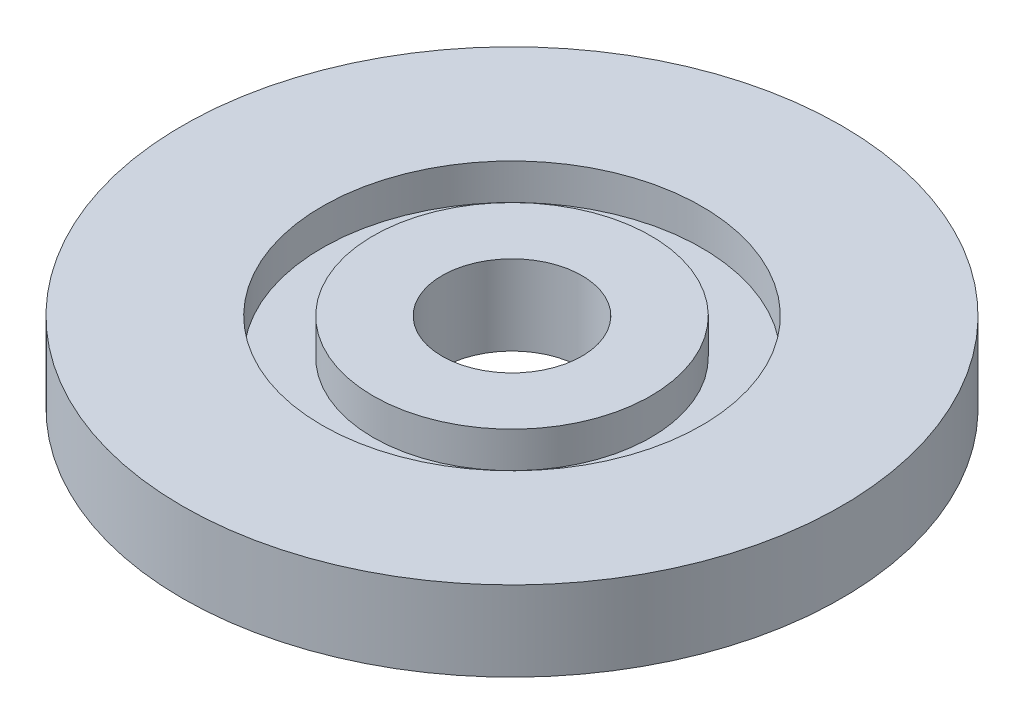
ISO-10303-21;
HEADER;
FILE_DESCRIPTION(('STEP AP214'),'2;1');
FILE_NAME('part.step','',(''),(''),'','','');
FILE_SCHEMA(('AUTOMOTIVE_DESIGN { 1 0 10303 214 1 1 1 1 }'));
ENDSEC;
DATA;
#1=APPLICATION_CONTEXT('core data for automotive mechanical design processes');
#2=APPLICATION_PROTOCOL_DEFINITION('international standard','automotive_design',2000,#1);
#3=PRODUCT_CONTEXT('',#1,'mechanical');
#4=PRODUCT('Part','Part','',(#3));
#5=PRODUCT_RELATED_PRODUCT_CATEGORY('part','',(#4));
#6=PRODUCT_DEFINITION_FORMATION('','',#4);
#7=PRODUCT_DEFINITION_CONTEXT('part definition',#1,'design');
#8=PRODUCT_DEFINITION('design','',#6,#7);
#9=PRODUCT_DEFINITION_SHAPE('','',#8);
#10=(LENGTH_UNIT() NAMED_UNIT(*) SI_UNIT(.MILLI.,.METRE.));
#11=(NAMED_UNIT(*) PLANE_ANGLE_UNIT() SI_UNIT($,.RADIAN.));
#12=(NAMED_UNIT(*) SI_UNIT($,.STERADIAN.) SOLID_ANGLE_UNIT());
#13=UNCERTAINTY_MEASURE_WITH_UNIT(LENGTH_MEASURE(1.E-05),#10,'distance_accuracy_value','');
#14=(GEOMETRIC_REPRESENTATION_CONTEXT(3) GLOBAL_UNCERTAINTY_ASSIGNED_CONTEXT((#13)) GLOBAL_UNIT_ASSIGNED_CONTEXT((#10,
#11,#12)) REPRESENTATION_CONTEXT('',''));
#15=CARTESIAN_POINT('',(0.,0.,0.));
#16=DIRECTION('',(0.,0.,1.));
#17=DIRECTION('',(1.,0.,0.));
#18=AXIS2_PLACEMENT_3D('',#15,#16,#17);
#19=CARTESIAN_POINT('',(0.,20.,0.));
#20=DIRECTION('',(0.,1.,0.));
#21=DIRECTION('',(0.,0.,1.));
#22=AXIS2_PLACEMENT_3D('',#19,#20,#21);
#23=PLANE('',#22);
#24=CARTESIAN_POINT('',(0.,20.,0.));
#25=DIRECTION('',(0.,1.,0.));
#26=DIRECTION('',(0.,0.,1.));
#27=AXIS2_PLACEMENT_3D('',#24,#25,#26);
#28=CIRCLE('',#27,17.5);
#29=CARTESIAN_POINT('',(0.,20.,17.5));
#30=VERTEX_POINT('',#29);
#31=EDGE_CURVE('E45',#30,#30,#28,.T.);
#32=ORIENTED_EDGE('',*,*,#31,.F.);
#33=EDGE_LOOP('',(#32));
#34=FACE_BOUND('',#33,.T.);
#35=CARTESIAN_POINT('',(0.,20.,0.));
#36=DIRECTION('',(0.,1.,0.));
#37=DIRECTION('',(0.,0.,1.));
#38=AXIS2_PLACEMENT_3D('',#35,#36,#37);
#39=CIRCLE('',#38,34.75);
#40=CARTESIAN_POINT('',(0.,20.,34.75));
#41=VERTEX_POINT('',#40);
#42=EDGE_CURVE('E57',#41,#41,#39,.T.);
#43=ORIENTED_EDGE('',*,*,#42,.T.);
#44=EDGE_LOOP('',(#43));
#45=FACE_BOUND('',#44,.T.);
#46=ADVANCED_FACE('F32',(#34,#45),#23,.T.);
#47=CARTESIAN_POINT('',(0.,20.,0.));
#48=DIRECTION('',(0.,-1.,0.));
#49=DIRECTION('',(0.,0.,-1.));
#50=AXIS2_PLACEMENT_3D('',#47,#48,#49);
#51=CYLINDRICAL_SURFACE('',#50,82.5);
#52=CARTESIAN_POINT('',(0.,20.,0.));
#53=DIRECTION('',(0.,1.,0.));
#54=DIRECTION('',(0.,0.,1.));
#55=AXIS2_PLACEMENT_3D('',#52,#53,#54);
#56=CIRCLE('',#55,82.5);
#57=CARTESIAN_POINT('',(0.,20.,82.5));
#58=VERTEX_POINT('',#57);
#59=EDGE_CURVE('E10',#58,#58,#56,.T.);
#60=ORIENTED_EDGE('',*,*,#59,.F.);
#61=EDGE_LOOP('',(#60));
#62=FACE_BOUND('',#61,.T.);
#63=CARTESIAN_POINT('',(0.,0.,0.));
#64=DIRECTION('',(0.,1.,0.));
#65=DIRECTION('',(0.,0.,1.));
#66=AXIS2_PLACEMENT_3D('',#63,#64,#65);
#67=CIRCLE('',#66,82.5);
#68=CARTESIAN_POINT('',(0.,0.,82.5));
#69=VERTEX_POINT('',#68);
#70=EDGE_CURVE('E36',#69,#69,#67,.T.);
#71=ORIENTED_EDGE('',*,*,#70,.T.);
#72=EDGE_LOOP('',(#71));
#73=FACE_BOUND('',#72,.T.);
#74=ADVANCED_FACE('F34',(#62,#73),#51,.T.);
#75=CARTESIAN_POINT('',(0.,20.,0.));
#76=DIRECTION('',(0.,1.,0.));
#77=DIRECTION('',(0.,0.,1.));
#78=AXIS2_PLACEMENT_3D('',#75,#76,#77);
#79=CIRCLE('',#78,47.5);
#80=CARTESIAN_POINT('',(0.,20.,47.5));
#81=VERTEX_POINT('',#80);
#82=EDGE_CURVE('E51',#81,#81,#79,.T.);
#83=ORIENTED_EDGE('',*,*,#82,.F.);
#84=EDGE_LOOP('',(#83));
#85=FACE_BOUND('',#84,.T.);
#86=ORIENTED_EDGE('',*,*,#59,.T.);
#87=EDGE_LOOP('',(#86));
#88=FACE_BOUND('',#87,.T.);
#89=ADVANCED_FACE('F112',(#85,#88),#23,.T.);
#90=CARTESIAN_POINT('',(0.,0.,0.));
#91=DIRECTION('',(0.,1.,0.));
#92=DIRECTION('',(0.,0.,1.));
#93=AXIS2_PLACEMENT_3D('',#90,#91,#92);
#94=PLANE('',#93);
#95=CARTESIAN_POINT('',(60.6217782649119,0.,35.0000000000021));
#96=DIRECTION('',(0.,-1.,0.));
#97=DIRECTION('',(0.,0.,-1.));
#98=AXIS2_PLACEMENT_3D('',#95,#96,#97);
#99=CIRCLE('',#98,2.50000000000001);
#100=CARTESIAN_POINT('',(60.6217782649119,0.,32.500000000002));
#101=VERTEX_POINT('',#100);
#102=EDGE_CURVE('E93',#101,#101,#99,.T.);
#103=ORIENTED_EDGE('',*,*,#102,.F.);
#104=EDGE_LOOP('',(#103));
#105=FACE_BOUND('',#104,.T.);
#106=CARTESIAN_POINT('',(60.6217782649142,0.,-34.999999999998));
#107=DIRECTION('',(0.,-1.,0.));
#108=DIRECTION('',(0.,0.,-1.));
#109=AXIS2_PLACEMENT_3D('',#106,#107,#108);
#110=CIRCLE('',#109,2.50000000000002);
#111=CARTESIAN_POINT('',(60.6217782649142,0.,-37.499999999998));
#112=VERTEX_POINT('',#111);
#113=EDGE_CURVE('E87',#112,#112,#110,.T.);
#114=ORIENTED_EDGE('',*,*,#113,.F.);
#115=EDGE_LOOP('',(#114));
#116=FACE_BOUND('',#115,.T.);
#117=CARTESIAN_POINT('',(4.67794791142476E-12,0.,-70.));
#118=DIRECTION('',(0.,-1.,0.));
#119=DIRECTION('',(0.,0.,-1.));
#120=AXIS2_PLACEMENT_3D('',#117,#118,#119);
#121=CIRCLE('',#120,2.5);
#122=CARTESIAN_POINT('',(4.67794791142476E-12,0.,-72.5));
#123=VERTEX_POINT('',#122);
#124=EDGE_CURVE('E81',#123,#123,#121,.T.);
#125=ORIENTED_EDGE('',*,*,#124,.F.);
#126=EDGE_LOOP('',(#125));
#127=FACE_BOUND('',#126,.T.);
#128=CARTESIAN_POINT('',(-60.6217782649072,0.,-35.0000000000021));
#129=DIRECTION('',(0.,-1.,0.));
#130=DIRECTION('',(0.,0.,-1.));
#131=AXIS2_PLACEMENT_3D('',#128,#129,#130);
#132=CIRCLE('',#131,2.5);
#133=CARTESIAN_POINT('',(-60.6217782649072,0.,-37.5000000000021));
#134=VERTEX_POINT('',#133);
#135=EDGE_CURVE('E75',#134,#134,#132,.T.);
#136=ORIENTED_EDGE('',*,*,#135,.F.);
#137=EDGE_LOOP('',(#136));
#138=FACE_BOUND('',#137,.T.);
#139=CARTESIAN_POINT('',(-60.6217782649096,0.,34.9999999999979));
#140=DIRECTION('',(0.,-1.,0.));
#141=DIRECTION('',(0.,0.,-1.));
#142=AXIS2_PLACEMENT_3D('',#139,#140,#141);
#143=CIRCLE('',#142,2.5);
#144=CARTESIAN_POINT('',(-60.6217782649096,0.,32.4999999999979));
#145=VERTEX_POINT('',#144);
#146=EDGE_CURVE('E69',#145,#145,#143,.T.);
#147=ORIENTED_EDGE('',*,*,#146,.F.);
#148=EDGE_LOOP('',(#147));
#149=FACE_BOUND('',#148,.T.);
#150=CARTESIAN_POINT('',(0.,0.,70.));
#151=DIRECTION('',(0.,-1.,0.));
#152=DIRECTION('',(0.,0.,-1.));
#153=AXIS2_PLACEMENT_3D('',#150,#151,#152);
#154=CIRCLE('',#153,2.5);
#155=CARTESIAN_POINT('',(0.,0.,67.5));
#156=VERTEX_POINT('',#155);
#157=EDGE_CURVE('E63',#156,#156,#154,.T.);
#158=ORIENTED_EDGE('',*,*,#157,.F.);
#159=EDGE_LOOP('',(#158));
#160=FACE_BOUND('',#159,.T.);
#161=CARTESIAN_POINT('',(0.,0.,0.));
#162=DIRECTION('',(0.,1.,0.));
#163=DIRECTION('',(0.,0.,1.));
#164=AXIS2_PLACEMENT_3D('',#161,#162,#163);
#165=CIRCLE('',#164,17.5);
#166=CARTESIAN_POINT('',(0.,0.,17.5));
#167=VERTEX_POINT('',#166);
#168=EDGE_CURVE('E43',#167,#167,#165,.T.);
#169=ORIENTED_EDGE('',*,*,#168,.T.);
#170=EDGE_LOOP('',(#169));
#171=FACE_BOUND('',#170,.T.);
#172=ORIENTED_EDGE('',*,*,#70,.F.);
#173=EDGE_LOOP('',(#172));
#174=FACE_BOUND('',#173,.T.);
#175=ADVANCED_FACE('F108',(#105,#116,#127,#138,#149,#160,#171,#174),#94,.F.);
#176=CARTESIAN_POINT('',(0.,0.,0.));
#177=DIRECTION('',(0.,1.,0.));
#178=DIRECTION('',(0.,0.,1.));
#179=AXIS2_PLACEMENT_3D('',#176,#177,#178);
#180=CYLINDRICAL_SURFACE('',#179,17.5);
#181=ORIENTED_EDGE('',*,*,#168,.F.);
#182=EDGE_LOOP('',(#181));
#183=FACE_BOUND('',#182,.T.);
#184=ORIENTED_EDGE('',*,*,#31,.T.);
#185=EDGE_LOOP('',(#184));
#186=FACE_BOUND('',#185,.T.);
#187=ADVANCED_FACE('F111',(#183,#186),#180,.F.);
#188=CARTESIAN_POINT('',(0.,11.,0.));
#189=DIRECTION('',(0.,1.,0.));
#190=DIRECTION('',(0.,0.,1.));
#191=AXIS2_PLACEMENT_3D('',#188,#189,#190);
#192=CYLINDRICAL_SURFACE('',#191,47.5);
#193=CARTESIAN_POINT('',(0.,11.,0.));
#194=DIRECTION('',(0.,1.,0.));
#195=DIRECTION('',(0.,0.,1.));
#196=AXIS2_PLACEMENT_3D('',#193,#194,#195);
#197=CIRCLE('',#196,47.5);
#198=CARTESIAN_POINT('',(0.,11.,47.5));
#199=VERTEX_POINT('',#198);
#200=EDGE_CURVE('E48',#199,#199,#197,.T.);
#201=ORIENTED_EDGE('',*,*,#200,.F.);
#202=EDGE_LOOP('',(#201));
#203=FACE_BOUND('',#202,.T.);
#204=ORIENTED_EDGE('',*,*,#82,.T.);
#205=EDGE_LOOP('',(#204));
#206=FACE_BOUND('',#205,.T.);
#207=ADVANCED_FACE('F143',(#203,#206),#192,.F.);
#208=CARTESIAN_POINT('',(0.,11.,0.));
#209=DIRECTION('',(0.,1.,0.));
#210=DIRECTION('',(0.,0.,1.));
#211=AXIS2_PLACEMENT_3D('',#208,#209,#210);
#212=PLANE('',#211);
#213=CARTESIAN_POINT('',(0.,11.,0.));
#214=DIRECTION('',(0.,1.,0.));
#215=DIRECTION('',(0.,0.,1.));
#216=AXIS2_PLACEMENT_3D('',#213,#214,#215);
#217=CIRCLE('',#216,34.75);
#218=CARTESIAN_POINT('',(0.,11.,34.75));
#219=VERTEX_POINT('',#218);
#220=EDGE_CURVE('E54',#219,#219,#217,.T.);
#221=ORIENTED_EDGE('',*,*,#220,.F.);
#222=EDGE_LOOP('',(#221));
#223=FACE_BOUND('',#222,.T.);
#224=ORIENTED_EDGE('',*,*,#200,.T.);
#225=EDGE_LOOP('',(#224));
#226=FACE_BOUND('',#225,.T.);
#227=ADVANCED_FACE('F147',(#223,#226),#212,.T.);
#228=CARTESIAN_POINT('',(0.,11.,0.));
#229=DIRECTION('',(0.,1.,0.));
#230=DIRECTION('',(0.,0.,1.));
#231=AXIS2_PLACEMENT_3D('',#228,#229,#230);
#232=CYLINDRICAL_SURFACE('',#231,34.75);
#233=ORIENTED_EDGE('',*,*,#220,.T.);
#234=EDGE_LOOP('',(#233));
#235=FACE_BOUND('',#234,.T.);
#236=ORIENTED_EDGE('',*,*,#42,.F.);
#237=EDGE_LOOP('',(#236));
#238=FACE_BOUND('',#237,.T.);
#239=ADVANCED_FACE('F151',(#235,#238),#232,.T.);
#240=CARTESIAN_POINT('',(0.,13.,70.));
#241=DIRECTION('',(0.,-1.,0.));
#242=DIRECTION('',(0.,0.,-1.));
#243=AXIS2_PLACEMENT_3D('',#240,#241,#242);
#244=CYLINDRICAL_SURFACE('',#243,2.5);
#245=CARTESIAN_POINT('',(0.,13.,70.));
#246=DIRECTION('',(0.,-1.,0.));
#247=DIRECTION('',(0.,0.,-1.));
#248=AXIS2_PLACEMENT_3D('',#245,#246,#247);
#249=CIRCLE('',#248,2.5);
#250=CARTESIAN_POINT('',(0.,13.,67.5));
#251=VERTEX_POINT('',#250);
#252=EDGE_CURVE('E60',#251,#251,#249,.T.);
#253=ORIENTED_EDGE('',*,*,#252,.F.);
#254=EDGE_LOOP('',(#253));
#255=FACE_BOUND('',#254,.T.);
#256=ORIENTED_EDGE('',*,*,#157,.T.);
#257=EDGE_LOOP('',(#256));
#258=FACE_BOUND('',#257,.T.);
#259=ADVANCED_FACE('F155',(#255,#258),#244,.F.);
#260=CARTESIAN_POINT('',(0.,13.,70.));
#261=DIRECTION('',(0.,-1.,0.));
#262=DIRECTION('',(0.,0.,-1.));
#263=AXIS2_PLACEMENT_3D('',#260,#261,#262);
#264=PLANE('',#263);
#265=ORIENTED_EDGE('',*,*,#252,.T.);
#266=EDGE_LOOP('',(#265));
#267=FACE_BOUND('',#266,.T.);
#268=ADVANCED_FACE('F159',(#267),#264,.T.);
#269=CARTESIAN_POINT('',(-60.6217782649096,13.,34.9999999999979));
#270=DIRECTION('',(0.,-1.,0.));
#271=DIRECTION('',(0.,0.,-1.));
#272=AXIS2_PLACEMENT_3D('',#269,#270,#271);
#273=CYLINDRICAL_SURFACE('',#272,2.5);
#274=CARTESIAN_POINT('',(-60.6217782649096,13.,34.9999999999979));
#275=DIRECTION('',(0.,-1.,0.));
#276=DIRECTION('',(0.,0.,-1.));
#277=AXIS2_PLACEMENT_3D('',#274,#275,#276);
#278=CIRCLE('',#277,2.5);
#279=CARTESIAN_POINT('',(-60.6217782649096,13.,32.4999999999979));
#280=VERTEX_POINT('',#279);
#281=EDGE_CURVE('E72',#280,#280,#278,.T.);
#282=ORIENTED_EDGE('',*,*,#281,.F.);
#283=EDGE_LOOP('',(#282));
#284=FACE_BOUND('',#283,.T.);
#285=ORIENTED_EDGE('',*,*,#146,.T.);
#286=EDGE_LOOP('',(#285));
#287=FACE_BOUND('',#286,.T.);
#288=ADVANCED_FACE('F163',(#284,#287),#273,.F.);
#289=CARTESIAN_POINT('',(-60.6217782649096,13.,34.9999999999979));
#290=DIRECTION('',(0.,-1.,0.));
#291=DIRECTION('',(0.,0.,-1.));
#292=AXIS2_PLACEMENT_3D('',#289,#290,#291);
#293=PLANE('',#292);
#294=ORIENTED_EDGE('',*,*,#281,.T.);
#295=EDGE_LOOP('',(#294));
#296=FACE_BOUND('',#295,.T.);
#297=ADVANCED_FACE('F167',(#296),#293,.T.);
#298=CARTESIAN_POINT('',(-60.6217782649072,13.,-35.0000000000021));
#299=DIRECTION('',(0.,-1.,0.));
#300=DIRECTION('',(0.,0.,-1.));
#301=AXIS2_PLACEMENT_3D('',#298,#299,#300);
#302=CYLINDRICAL_SURFACE('',#301,2.5);
#303=CARTESIAN_POINT('',(-60.6217782649072,13.,-35.0000000000021));
#304=DIRECTION('',(0.,-1.,0.));
#305=DIRECTION('',(0.,0.,-1.));
#306=AXIS2_PLACEMENT_3D('',#303,#304,#305);
#307=CIRCLE('',#306,2.5);
#308=CARTESIAN_POINT('',(-60.6217782649072,13.,-37.5000000000021));
#309=VERTEX_POINT('',#308);
#310=EDGE_CURVE('E78',#309,#309,#307,.T.);
#311=ORIENTED_EDGE('',*,*,#310,.F.);
#312=EDGE_LOOP('',(#311));
#313=FACE_BOUND('',#312,.T.);
#314=ORIENTED_EDGE('',*,*,#135,.T.);
#315=EDGE_LOOP('',(#314));
#316=FACE_BOUND('',#315,.T.);
#317=ADVANCED_FACE('F171',(#313,#316),#302,.F.);
#318=CARTESIAN_POINT('',(-60.6217782649072,13.,-35.0000000000021));
#319=DIRECTION('',(0.,-1.,0.));
#320=DIRECTION('',(0.,0.,-1.));
#321=AXIS2_PLACEMENT_3D('',#318,#319,#320);
#322=PLANE('',#321);
#323=ORIENTED_EDGE('',*,*,#310,.T.);
#324=EDGE_LOOP('',(#323));
#325=FACE_BOUND('',#324,.T.);
#326=ADVANCED_FACE('F175',(#325),#322,.T.);
#327=CARTESIAN_POINT('',(4.67794791142476E-12,13.,-70.));
#328=DIRECTION('',(0.,-1.,0.));
#329=DIRECTION('',(0.,0.,-1.));
#330=AXIS2_PLACEMENT_3D('',#327,#328,#329);
#331=CYLINDRICAL_SURFACE('',#330,2.5);
#332=CARTESIAN_POINT('',(4.67794791142476E-12,13.,-70.));
#333=DIRECTION('',(0.,-1.,0.));
#334=DIRECTION('',(0.,0.,-1.));
#335=AXIS2_PLACEMENT_3D('',#332,#333,#334);
#336=CIRCLE('',#335,2.5);
#337=CARTESIAN_POINT('',(4.67794791142476E-12,13.,-72.5));
#338=VERTEX_POINT('',#337);
#339=EDGE_CURVE('E84',#338,#338,#336,.T.);
#340=ORIENTED_EDGE('',*,*,#339,.F.);
#341=EDGE_LOOP('',(#340));
#342=FACE_BOUND('',#341,.T.);
#343=ORIENTED_EDGE('',*,*,#124,.T.);
#344=EDGE_LOOP('',(#343));
#345=FACE_BOUND('',#344,.T.);
#346=ADVANCED_FACE('F179',(#342,#345),#331,.F.);
#347=CARTESIAN_POINT('',(4.67794791142476E-12,13.,-70.));
#348=DIRECTION('',(0.,-1.,0.));
#349=DIRECTION('',(0.,0.,-1.));
#350=AXIS2_PLACEMENT_3D('',#347,#348,#349);
#351=PLANE('',#350);
#352=ORIENTED_EDGE('',*,*,#339,.T.);
#353=EDGE_LOOP('',(#352));
#354=FACE_BOUND('',#353,.T.);
#355=ADVANCED_FACE('F183',(#354),#351,.T.);
#356=CARTESIAN_POINT('',(60.6217782649142,13.,-34.999999999998));
#357=DIRECTION('',(0.,-1.,0.));
#358=DIRECTION('',(0.,0.,-1.));
#359=AXIS2_PLACEMENT_3D('',#356,#357,#358);
#360=CYLINDRICAL_SURFACE('',#359,2.50000000000002);
#361=CARTESIAN_POINT('',(60.6217782649142,13.,-34.999999999998));
#362=DIRECTION('',(0.,-1.,0.));
#363=DIRECTION('',(0.,0.,-1.));
#364=AXIS2_PLACEMENT_3D('',#361,#362,#363);
#365=CIRCLE('',#364,2.50000000000002);
#366=CARTESIAN_POINT('',(60.6217782649142,13.,-37.499999999998));
#367=VERTEX_POINT('',#366);
#368=EDGE_CURVE('E90',#367,#367,#365,.T.);
#369=ORIENTED_EDGE('',*,*,#368,.F.);
#370=EDGE_LOOP('',(#369));
#371=FACE_BOUND('',#370,.T.);
#372=ORIENTED_EDGE('',*,*,#113,.T.);
#373=EDGE_LOOP('',(#372));
#374=FACE_BOUND('',#373,.T.);
#375=ADVANCED_FACE('F187',(#371,#374),#360,.F.);
#376=CARTESIAN_POINT('',(60.6217782649142,13.,-34.999999999998));
#377=DIRECTION('',(0.,-1.,0.));
#378=DIRECTION('',(0.,0.,-1.));
#379=AXIS2_PLACEMENT_3D('',#376,#377,#378);
#380=PLANE('',#379);
#381=ORIENTED_EDGE('',*,*,#368,.T.);
#382=EDGE_LOOP('',(#381));
#383=FACE_BOUND('',#382,.T.);
#384=ADVANCED_FACE('F104',(#383),#380,.T.);
#385=CARTESIAN_POINT('',(60.6217782649119,13.,35.0000000000021));
#386=DIRECTION('',(0.,-1.,0.));
#387=DIRECTION('',(0.,0.,-1.));
#388=AXIS2_PLACEMENT_3D('',#385,#386,#387);
#389=CYLINDRICAL_SURFACE('',#388,2.50000000000001);
#390=CARTESIAN_POINT('',(60.6217782649119,13.,35.0000000000021));
#391=DIRECTION('',(0.,-1.,0.));
#392=DIRECTION('',(0.,0.,-1.));
#393=AXIS2_PLACEMENT_3D('',#390,#391,#392);
#394=CIRCLE('',#393,2.50000000000001);
#395=CARTESIAN_POINT('',(60.6217782649119,13.,32.500000000002));
#396=VERTEX_POINT('',#395);
#397=EDGE_CURVE('E66',#396,#396,#394,.T.);
#398=ORIENTED_EDGE('',*,*,#397,.F.);
#399=EDGE_LOOP('',(#398));
#400=FACE_BOUND('',#399,.T.);
#401=ORIENTED_EDGE('',*,*,#102,.T.);
#402=EDGE_LOOP('',(#401));
#403=FACE_BOUND('',#402,.T.);
#404=ADVANCED_FACE('F101',(#400,#403),#389,.F.);
#405=CARTESIAN_POINT('',(60.6217782649119,13.,35.0000000000021));
#406=DIRECTION('',(0.,-1.,0.));
#407=DIRECTION('',(0.,0.,-1.));
#408=AXIS2_PLACEMENT_3D('',#405,#406,#407);
#409=PLANE('',#408);
#410=ORIENTED_EDGE('',*,*,#397,.T.);
#411=EDGE_LOOP('',(#410));
#412=FACE_BOUND('',#411,.T.);
#413=ADVANCED_FACE('F99',(#412),#409,.T.);
#414=CLOSED_SHELL('',(#46,#74,#89,#175,#187,#207,#227,#239,#259,#268,#288,#297,#317,#326,#346,
#355,#375,#384,#404,#413));
#415=MANIFOLD_SOLID_BREP('B2',#414);
#416=ADVANCED_BREP_SHAPE_REPRESENTATION('',(#18,#415),#14);
#417=SHAPE_DEFINITION_REPRESENTATION(#9,#416);
ENDSEC;
END-ISO-10303-21;
